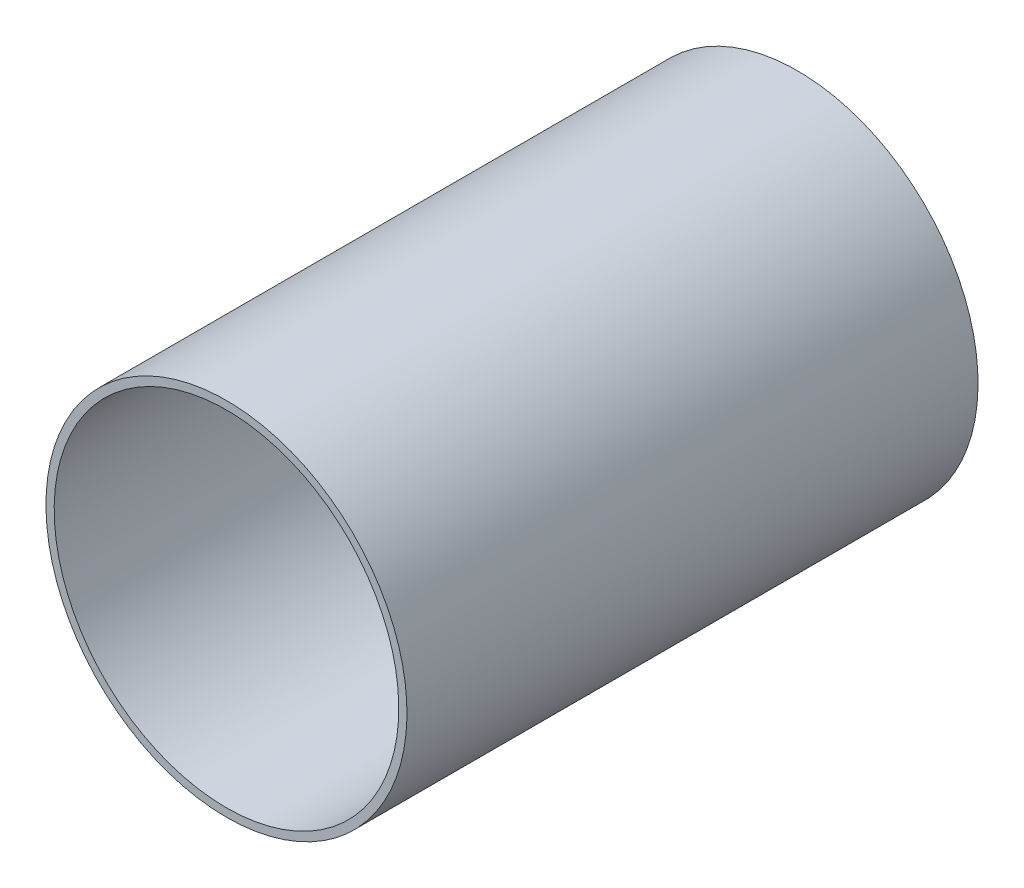
ISO-10303-21;
HEADER;
FILE_DESCRIPTION(('STEP AP214'),'2;1');
FILE_NAME('part.step','',(''),(''),'','','');
FILE_SCHEMA(('AUTOMOTIVE_DESIGN { 1 0 10303 214 1 1 1 1 }'));
ENDSEC;
DATA;
#1=APPLICATION_CONTEXT('core data for automotive mechanical design processes');
#2=APPLICATION_PROTOCOL_DEFINITION('international standard','automotive_design',2000,#1);
#3=PRODUCT_CONTEXT('',#1,'mechanical');
#4=PRODUCT('Part','Part','',(#3));
#5=PRODUCT_RELATED_PRODUCT_CATEGORY('part','',(#4));
#6=PRODUCT_DEFINITION_FORMATION('','',#4);
#7=PRODUCT_DEFINITION_CONTEXT('part definition',#1,'design');
#8=PRODUCT_DEFINITION('design','',#6,#7);
#9=PRODUCT_DEFINITION_SHAPE('','',#8);
#10=(LENGTH_UNIT() NAMED_UNIT(*) SI_UNIT(.MILLI.,.METRE.));
#11=(NAMED_UNIT(*) PLANE_ANGLE_UNIT() SI_UNIT($,.RADIAN.));
#12=(NAMED_UNIT(*) SI_UNIT($,.STERADIAN.) SOLID_ANGLE_UNIT());
#13=UNCERTAINTY_MEASURE_WITH_UNIT(LENGTH_MEASURE(1.E-05),#10,'distance_accuracy_value','');
#14=(GEOMETRIC_REPRESENTATION_CONTEXT(3) GLOBAL_UNCERTAINTY_ASSIGNED_CONTEXT((#13)) GLOBAL_UNIT_ASSIGNED_CONTEXT((#10,
#11,#12)) REPRESENTATION_CONTEXT('',''));
#15=CARTESIAN_POINT('',(0.,0.,0.));
#16=DIRECTION('',(0.,0.,1.));
#17=DIRECTION('',(1.,0.,0.));
#18=AXIS2_PLACEMENT_3D('',#15,#16,#17);
#19=CARTESIAN_POINT('',(131.852,-111.734,-0.045));
#20=DIRECTION('',(0.,0.,-1.));
#21=DIRECTION('',(0.,-1.,0.));
#22=AXIS2_PLACEMENT_3D('',#19,#20,#21);
#23=CYLINDRICAL_SURFACE('',#22,0.525);
#24=CARTESIAN_POINT('',(131.852,-111.734,-0.035));
#25=DIRECTION('',(0.,0.,-1.));
#26=DIRECTION('',(0.,-1.,0.));
#27=AXIS2_PLACEMENT_3D('',#24,#25,#26);
#28=CIRCLE('',#27,0.525);
#29=CARTESIAN_POINT('',(131.852,-112.259,-0.035));
#30=VERTEX_POINT('',#29);
#31=EDGE_CURVE('E64',#30,#30,#28,.T.);
#32=ORIENTED_EDGE('',*,*,#31,.T.);
#33=DIRECTION('',(0.,0.,1.));
#34=VECTOR('',#33,1.);
#35=CARTESIAN_POINT('',(131.852,-112.259,-0.045));
#36=LINE('',#35,#34);
#37=CARTESIAN_POINT('',(131.852,-112.259,1.705));
#38=VERTEX_POINT('',#37);
#39=EDGE_CURVE('E11',#30,#38,#36,.T.);
#40=ORIENTED_EDGE('',*,*,#39,.T.);
#41=CARTESIAN_POINT('',(131.852,-111.734,1.705));
#42=DIRECTION('',(0.,0.,-1.));
#43=DIRECTION('',(0.,-1.,0.));
#44=AXIS2_PLACEMENT_3D('',#41,#42,#43);
#45=CIRCLE('',#44,0.525);
#46=EDGE_CURVE('E25',#38,#38,#45,.T.);
#47=ORIENTED_EDGE('',*,*,#46,.F.);
#48=ORIENTED_EDGE('',*,*,#39,.F.);
#49=EDGE_LOOP('',(#32,#40,#47,#48));
#50=FACE_BOUND('',#49,.T.);
#51=ADVANCED_FACE('F17',(#50),#23,.F.);
#52=CARTESIAN_POINT('',(131.852,-112.284,1.705));
#53=DIRECTION('',(0.,0.,1.));
#54=DIRECTION('',(1.,0.,0.));
#55=AXIS2_PLACEMENT_3D('',#52,#53,#54);
#56=PLANE('',#55);
#57=ORIENTED_EDGE('',*,*,#46,.T.);
#58=EDGE_LOOP('',(#57));
#59=FACE_BOUND('',#58,.T.);
#60=CARTESIAN_POINT('',(131.852,-111.734,1.705));
#61=DIRECTION('',(0.,0.,1.));
#62=DIRECTION('',(0.,-1.,0.));
#63=AXIS2_PLACEMENT_3D('',#60,#61,#62);
#64=CIRCLE('',#63,0.55);
#65=CARTESIAN_POINT('',(131.852,-112.284,1.705));
#66=VERTEX_POINT('',#65);
#67=EDGE_CURVE('E56',#66,#66,#64,.T.);
#68=ORIENTED_EDGE('',*,*,#67,.T.);
#69=EDGE_LOOP('',(#68));
#70=FACE_BOUND('',#69,.T.);
#71=ADVANCED_FACE('F80',(#59,#70),#56,.T.);
#72=CARTESIAN_POINT('',(131.852,-112.284,-0.035));
#73=DIRECTION('',(0.,0.,1.));
#74=DIRECTION('',(1.,0.,0.));
#75=AXIS2_PLACEMENT_3D('',#72,#73,#74);
#76=PLANE('',#75);
#77=ORIENTED_EDGE('',*,*,#31,.F.);
#78=EDGE_LOOP('',(#77));
#79=FACE_BOUND('',#78,.T.);
#80=CARTESIAN_POINT('',(131.852,-111.734,-0.035));
#81=DIRECTION('',(0.,0.,1.));
#82=DIRECTION('',(0.,-1.,0.));
#83=AXIS2_PLACEMENT_3D('',#80,#81,#82);
#84=CIRCLE('',#83,0.55);
#85=CARTESIAN_POINT('',(131.852,-112.284,-0.035));
#86=VERTEX_POINT('',#85);
#87=EDGE_CURVE('E55',#86,#86,#84,.T.);
#88=ORIENTED_EDGE('',*,*,#87,.F.);
#89=EDGE_LOOP('',(#88));
#90=FACE_BOUND('',#89,.T.);
#91=ADVANCED_FACE('F77',(#79,#90),#76,.F.);
#92=CARTESIAN_POINT('',(131.852,-111.734,-0.035));
#93=DIRECTION('',(0.,0.,-1.));
#94=DIRECTION('',(0.,-1.,0.));
#95=AXIS2_PLACEMENT_3D('',#92,#93,#94);
#96=CYLINDRICAL_SURFACE('',#95,0.55);
#97=ORIENTED_EDGE('',*,*,#87,.T.);
#98=DIRECTION('',(0.,0.,1.));
#99=VECTOR('',#98,1.);
#100=CARTESIAN_POINT('',(131.852,-112.284,-0.035));
#101=LINE('',#100,#99);
#102=EDGE_CURVE('E52',#86,#66,#101,.T.);
#103=ORIENTED_EDGE('',*,*,#102,.T.);
#104=ORIENTED_EDGE('',*,*,#67,.F.);
#105=ORIENTED_EDGE('',*,*,#102,.F.);
#106=EDGE_LOOP('',(#97,#103,#104,#105));
#107=FACE_BOUND('',#106,.T.);
#108=ADVANCED_FACE('F53',(#107),#96,.T.);
#109=CLOSED_SHELL('',(#51,#71,#91,#108));
#110=MANIFOLD_SOLID_BREP('B1',#109);
#111=ADVANCED_BREP_SHAPE_REPRESENTATION('',(#18,#110),#14);
#112=SHAPE_DEFINITION_REPRESENTATION(#9,#111);
ENDSEC;
END-ISO-10303-21;
